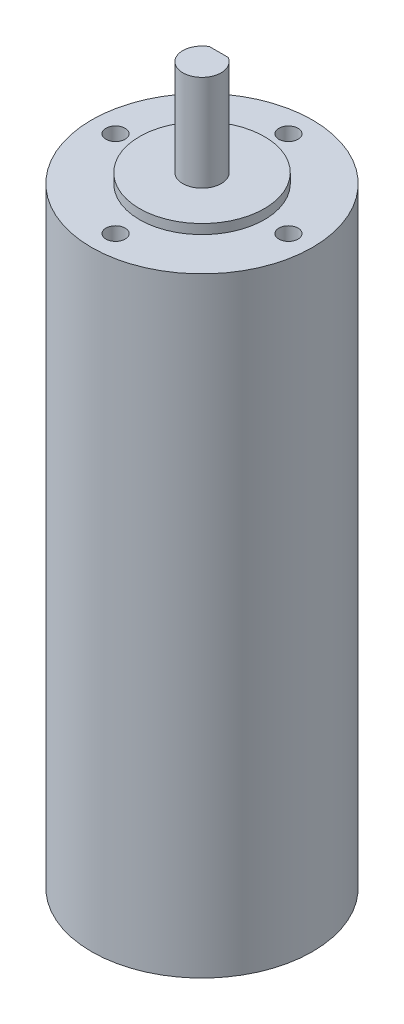
ISO-10303-21;
HEADER;
FILE_DESCRIPTION(('STEP AP214'),'2;1');
FILE_NAME('part.step','',(''),(''),'','','');
FILE_SCHEMA(('AUTOMOTIVE_DESIGN { 1 0 10303 214 1 1 1 1 }'));
ENDSEC;
DATA;
#1=APPLICATION_CONTEXT('core data for automotive mechanical design processes');
#2=APPLICATION_PROTOCOL_DEFINITION('international standard','automotive_design',2000,#1);
#3=PRODUCT_CONTEXT('',#1,'mechanical');
#4=PRODUCT('Part','Part','',(#3));
#5=PRODUCT_RELATED_PRODUCT_CATEGORY('part','',(#4));
#6=PRODUCT_DEFINITION_FORMATION('','',#4);
#7=PRODUCT_DEFINITION_CONTEXT('part definition',#1,'design');
#8=PRODUCT_DEFINITION('design','',#6,#7);
#9=PRODUCT_DEFINITION_SHAPE('','',#8);
#10=(LENGTH_UNIT() NAMED_UNIT(*) SI_UNIT(.MILLI.,.METRE.));
#11=(NAMED_UNIT(*) PLANE_ANGLE_UNIT() SI_UNIT($,.RADIAN.));
#12=(NAMED_UNIT(*) SI_UNIT($,.STERADIAN.) SOLID_ANGLE_UNIT());
#13=UNCERTAINTY_MEASURE_WITH_UNIT(LENGTH_MEASURE(1.E-05),#10,'distance_accuracy_value','');
#14=(GEOMETRIC_REPRESENTATION_CONTEXT(3) GLOBAL_UNCERTAINTY_ASSIGNED_CONTEXT((#13)) GLOBAL_UNIT_ASSIGNED_CONTEXT((#10,
#11,#12)) REPRESENTATION_CONTEXT('',''));
#15=CARTESIAN_POINT('',(0.,0.,0.));
#16=DIRECTION('',(0.,0.,1.));
#17=DIRECTION('',(1.,0.,0.));
#18=AXIS2_PLACEMENT_3D('',#15,#16,#17);
#19=CARTESIAN_POINT('',(0.,127.,0.));
#20=DIRECTION('',(0.,-1.,0.));
#21=DIRECTION('',(0.,0.,-1.));
#22=AXIS2_PLACEMENT_3D('',#19,#20,#21);
#23=CYLINDRICAL_SURFACE('',#22,23.);
#24=CARTESIAN_POINT('',(0.,127.,0.));
#25=DIRECTION('',(0.,1.,0.));
#26=DIRECTION('',(0.,0.,1.));
#27=AXIS2_PLACEMENT_3D('',#24,#25,#26);
#28=CIRCLE('',#27,23.);
#29=CARTESIAN_POINT('',(0.,127.,23.));
#30=VERTEX_POINT('',#29);
#31=EDGE_CURVE('E102',#30,#30,#28,.T.);
#32=ORIENTED_EDGE('',*,*,#31,.F.);
#33=EDGE_LOOP('',(#32));
#34=FACE_BOUND('',#33,.T.);
#35=CARTESIAN_POINT('',(0.,0.,0.));
#36=DIRECTION('',(0.,1.,0.));
#37=DIRECTION('',(0.,0.,1.));
#38=AXIS2_PLACEMENT_3D('',#35,#36,#37);
#39=CIRCLE('',#38,23.);
#40=CARTESIAN_POINT('',(0.,0.,23.));
#41=VERTEX_POINT('',#40);
#42=EDGE_CURVE('E44',#41,#41,#39,.T.);
#43=ORIENTED_EDGE('',*,*,#42,.T.);
#44=EDGE_LOOP('',(#43));
#45=FACE_BOUND('',#44,.T.);
#46=ADVANCED_FACE('F41',(#34,#45),#23,.T.);
#47=CARTESIAN_POINT('',(0.,127.,0.));
#48=DIRECTION('',(0.,1.,0.));
#49=DIRECTION('',(0.,0.,1.));
#50=AXIS2_PLACEMENT_3D('',#47,#48,#49);
#51=PLANE('',#50);
#52=CARTESIAN_POINT('',(0.,127.,-18.));
#53=DIRECTION('',(0.,1.,0.));
#54=DIRECTION('',(0.,0.,1.));
#55=AXIS2_PLACEMENT_3D('',#52,#53,#54);
#56=CIRCLE('',#55,2.);
#57=CARTESIAN_POINT('',(0.,127.,-16.));
#58=VERTEX_POINT('',#57);
#59=EDGE_CURVE('E95',#58,#58,#56,.T.);
#60=ORIENTED_EDGE('',*,*,#59,.F.);
#61=EDGE_LOOP('',(#60));
#62=FACE_BOUND('',#61,.T.);
#63=CARTESIAN_POINT('',(18.0000000000005,127.,-5.09386405508807E-13));
#64=DIRECTION('',(0.,1.,0.));
#65=DIRECTION('',(0.,0.,1.));
#66=AXIS2_PLACEMENT_3D('',#63,#64,#65);
#67=CIRCLE('',#66,2.);
#68=CARTESIAN_POINT('',(18.0000000000005,127.,1.99999999999949));
#69=VERTEX_POINT('',#68);
#70=EDGE_CURVE('E327',#69,#69,#67,.T.);
#71=ORIENTED_EDGE('',*,*,#70,.F.);
#72=EDGE_LOOP('',(#71));
#73=FACE_BOUND('',#72,.T.);
#74=CARTESIAN_POINT('',(9.96775622051246E-13,127.,18.));
#75=DIRECTION('',(0.,1.,0.));
#76=DIRECTION('',(0.,0.,1.));
#77=AXIS2_PLACEMENT_3D('',#74,#75,#76);
#78=CIRCLE('',#77,2.);
#79=CARTESIAN_POINT('',(9.96775622051246E-13,127.,20.));
#80=VERTEX_POINT('',#79);
#81=EDGE_CURVE('E335',#80,#80,#78,.T.);
#82=ORIENTED_EDGE('',*,*,#81,.F.);
#83=EDGE_LOOP('',(#82));
#84=FACE_BOUND('',#83,.T.);
#85=CARTESIAN_POINT('',(-17.9999999999995,127.,5.11590769747272E-13));
#86=DIRECTION('',(0.,1.,0.));
#87=DIRECTION('',(0.,0.,1.));
#88=AXIS2_PLACEMENT_3D('',#85,#86,#87);
#89=CIRCLE('',#88,2.);
#90=CARTESIAN_POINT('',(-17.9999999999995,127.,2.00000000000051));
#91=VERTEX_POINT('',#90);
#92=EDGE_CURVE('E83',#91,#91,#89,.T.);
#93=ORIENTED_EDGE('',*,*,#92,.F.);
#94=EDGE_LOOP('',(#93));
#95=FACE_BOUND('',#94,.T.);
#96=CARTESIAN_POINT('',(0.,127.,0.));
#97=DIRECTION('',(0.,1.,0.));
#98=DIRECTION('',(0.,0.,1.));
#99=AXIS2_PLACEMENT_3D('',#96,#97,#98);
#100=CIRCLE('',#99,13.);
#101=CARTESIAN_POINT('',(0.,127.,13.));
#102=VERTEX_POINT('',#101);
#103=EDGE_CURVE('E50',#102,#102,#100,.T.);
#104=ORIENTED_EDGE('',*,*,#103,.F.);
#105=EDGE_LOOP('',(#104));
#106=FACE_BOUND('',#105,.T.);
#107=ORIENTED_EDGE('',*,*,#31,.T.);
#108=EDGE_LOOP('',(#107));
#109=FACE_BOUND('',#108,.T.);
#110=ADVANCED_FACE('F115',(#62,#73,#84,#95,#106,#109),#51,.T.);
#111=CARTESIAN_POINT('',(0.,0.,0.));
#112=DIRECTION('',(0.,1.,0.));
#113=DIRECTION('',(0.,0.,1.));
#114=AXIS2_PLACEMENT_3D('',#111,#112,#113);
#115=PLANE('',#114);
#116=ORIENTED_EDGE('',*,*,#42,.F.);
#117=EDGE_LOOP('',(#116));
#118=FACE_BOUND('',#117,.T.);
#119=ADVANCED_FACE('F112',(#118),#115,.F.);
#120=CARTESIAN_POINT('',(0.,129.,0.));
#121=DIRECTION('',(0.,-1.,0.));
#122=DIRECTION('',(0.,0.,-1.));
#123=AXIS2_PLACEMENT_3D('',#120,#121,#122);
#124=CYLINDRICAL_SURFACE('',#123,13.);
#125=CARTESIAN_POINT('',(0.,129.,0.));
#126=DIRECTION('',(0.,1.,0.));
#127=DIRECTION('',(0.,0.,1.));
#128=AXIS2_PLACEMENT_3D('',#125,#126,#127);
#129=CIRCLE('',#128,13.);
#130=CARTESIAN_POINT('',(0.,129.,13.));
#131=VERTEX_POINT('',#130);
#132=EDGE_CURVE('E87',#131,#131,#129,.T.);
#133=ORIENTED_EDGE('',*,*,#132,.F.);
#134=EDGE_LOOP('',(#133));
#135=FACE_BOUND('',#134,.T.);
#136=ORIENTED_EDGE('',*,*,#103,.T.);
#137=EDGE_LOOP('',(#136));
#138=FACE_BOUND('',#137,.T.);
#139=ADVANCED_FACE('F114',(#135,#138),#124,.T.);
#140=CARTESIAN_POINT('',(0.,129.,0.));
#141=DIRECTION('',(0.,1.,0.));
#142=DIRECTION('',(0.,0.,1.));
#143=AXIS2_PLACEMENT_3D('',#140,#141,#142);
#144=PLANE('',#143);
#145=CARTESIAN_POINT('',(0.,129.,0.));
#146=DIRECTION('',(0.,1.,0.));
#147=DIRECTION('',(0.,0.,1.));
#148=AXIS2_PLACEMENT_3D('',#145,#146,#147);
#149=CIRCLE('',#148,4.);
#150=CARTESIAN_POINT('',(0.,129.,4.));
#151=VERTEX_POINT('',#150);
#152=EDGE_CURVE('E11',#151,#151,#149,.T.);
#153=ORIENTED_EDGE('',*,*,#152,.F.);
#154=EDGE_LOOP('',(#153));
#155=FACE_BOUND('',#154,.T.);
#156=ORIENTED_EDGE('',*,*,#132,.T.);
#157=EDGE_LOOP('',(#156));
#158=FACE_BOUND('',#157,.T.);
#159=ADVANCED_FACE('F120',(#155,#158),#144,.T.);
#160=CARTESIAN_POINT('',(0.,149.,0.));
#161=DIRECTION('',(0.,-1.,0.));
#162=DIRECTION('',(0.,0.,-1.));
#163=AXIS2_PLACEMENT_3D('',#160,#161,#162);
#164=CYLINDRICAL_SURFACE('',#163,4.);
#165=CARTESIAN_POINT('',(0.,149.,0.));
#166=DIRECTION('',(0.,1.,0.));
#167=DIRECTION('',(0.,0.,1.));
#168=AXIS2_PLACEMENT_3D('',#165,#166,#167);
#169=CIRCLE('',#168,4.);
#170=CARTESIAN_POINT('',(-1.93649167310371,149.,-3.5));
#171=VERTEX_POINT('',#170);
#172=CARTESIAN_POINT('',(1.93649167310371,149.,-3.5));
#173=VERTEX_POINT('',#172);
#174=EDGE_CURVE('E81',#171,#173,#169,.T.);
#175=ORIENTED_EDGE('',*,*,#174,.F.);
#176=DIRECTION('',(0.,1.,0.));
#177=VECTOR('',#176,1.);
#178=CARTESIAN_POINT('',(-1.93649167310371,137.,-3.5));
#179=LINE('',#178,#177);
#180=CARTESIAN_POINT('',(-1.93649167310371,137.,-3.5));
#181=VERTEX_POINT('',#180);
#182=EDGE_CURVE('E58',#181,#171,#179,.T.);
#183=ORIENTED_EDGE('',*,*,#182,.F.);
#184=CARTESIAN_POINT('',(0.,137.,0.));
#185=DIRECTION('',(0.,1.,0.));
#186=DIRECTION('',(0.,0.,1.));
#187=AXIS2_PLACEMENT_3D('',#184,#185,#186);
#188=CIRCLE('',#187,4.);
#189=CARTESIAN_POINT('',(1.93649167310371,137.,-3.5));
#190=VERTEX_POINT('',#189);
#191=EDGE_CURVE('E75',#190,#181,#188,.T.);
#192=ORIENTED_EDGE('',*,*,#191,.F.);
#193=DIRECTION('',(0.,1.,0.));
#194=VECTOR('',#193,1.);
#195=CARTESIAN_POINT('',(1.93649167310371,137.,-3.5));
#196=LINE('',#195,#194);
#197=EDGE_CURVE('E64',#190,#173,#196,.T.);
#198=ORIENTED_EDGE('',*,*,#197,.T.);
#199=EDGE_LOOP('',(#175,#183,#192,#198));
#200=FACE_BOUND('',#199,.T.);
#201=ORIENTED_EDGE('',*,*,#152,.T.);
#202=EDGE_LOOP('',(#201));
#203=FACE_BOUND('',#202,.T.);
#204=ADVANCED_FACE('F79',(#200,#203),#164,.T.);
#205=CARTESIAN_POINT('',(0.,149.,0.));
#206=DIRECTION('',(0.,1.,0.));
#207=DIRECTION('',(0.,0.,1.));
#208=AXIS2_PLACEMENT_3D('',#205,#206,#207);
#209=PLANE('',#208);
#210=DIRECTION('',(1.,0.,0.));
#211=VECTOR('',#210,1.);
#212=CARTESIAN_POINT('',(0.,149.,-3.5));
#213=LINE('',#212,#211);
#214=EDGE_CURVE('E69',#171,#173,#213,.T.);
#215=ORIENTED_EDGE('',*,*,#214,.F.);
#216=ORIENTED_EDGE('',*,*,#174,.T.);
#217=EDGE_LOOP('',(#215,#216));
#218=FACE_BOUND('',#217,.T.);
#219=ADVANCED_FACE('F85',(#218),#209,.T.);
#220=CARTESIAN_POINT('',(-17.9999999999995,117.,5.11590769747272E-13));
#221=DIRECTION('',(0.,1.,0.));
#222=DIRECTION('',(0.,0.,1.));
#223=AXIS2_PLACEMENT_3D('',#220,#221,#222);
#224=CYLINDRICAL_SURFACE('',#223,2.);
#225=CARTESIAN_POINT('',(-17.9999999999995,117.,5.11590769747272E-13));
#226=DIRECTION('',(0.,1.,0.));
#227=DIRECTION('',(0.,0.,1.));
#228=AXIS2_PLACEMENT_3D('',#225,#226,#227);
#229=CIRCLE('',#228,2.);
#230=CARTESIAN_POINT('',(-17.9999999999995,117.,2.00000000000051));
#231=VERTEX_POINT('',#230);
#232=EDGE_CURVE('E338',#231,#231,#229,.T.);
#233=ORIENTED_EDGE('',*,*,#232,.F.);
#234=EDGE_LOOP('',(#233));
#235=FACE_BOUND('',#234,.T.);
#236=ORIENTED_EDGE('',*,*,#92,.T.);
#237=EDGE_LOOP('',(#236));
#238=FACE_BOUND('',#237,.T.);
#239=ADVANCED_FACE('F143',(#235,#238),#224,.F.);
#240=CARTESIAN_POINT('',(-17.9999999999995,117.,5.11590769747272E-13));
#241=DIRECTION('',(0.,1.,0.));
#242=DIRECTION('',(0.,0.,1.));
#243=AXIS2_PLACEMENT_3D('',#240,#241,#242);
#244=PLANE('',#243);
#245=ORIENTED_EDGE('',*,*,#232,.T.);
#246=EDGE_LOOP('',(#245));
#247=FACE_BOUND('',#246,.T.);
#248=ADVANCED_FACE('F149',(#247),#244,.T.);
#249=CARTESIAN_POINT('',(9.96775622051246E-13,117.,18.));
#250=DIRECTION('',(0.,1.,0.));
#251=DIRECTION('',(0.,0.,1.));
#252=AXIS2_PLACEMENT_3D('',#249,#250,#251);
#253=CYLINDRICAL_SURFACE('',#252,2.);
#254=CARTESIAN_POINT('',(9.96775622051246E-13,117.,18.));
#255=DIRECTION('',(0.,1.,0.));
#256=DIRECTION('',(0.,0.,1.));
#257=AXIS2_PLACEMENT_3D('',#254,#255,#256);
#258=CIRCLE('',#257,2.);
#259=CARTESIAN_POINT('',(9.96775622051246E-13,117.,20.));
#260=VERTEX_POINT('',#259);
#261=EDGE_CURVE('E331',#260,#260,#258,.T.);
#262=ORIENTED_EDGE('',*,*,#261,.F.);
#263=EDGE_LOOP('',(#262));
#264=FACE_BOUND('',#263,.T.);
#265=ORIENTED_EDGE('',*,*,#81,.T.);
#266=EDGE_LOOP('',(#265));
#267=FACE_BOUND('',#266,.T.);
#268=ADVANCED_FACE('F163',(#264,#267),#253,.F.);
#269=CARTESIAN_POINT('',(9.96775622051246E-13,117.,18.));
#270=DIRECTION('',(0.,1.,0.));
#271=DIRECTION('',(0.,0.,1.));
#272=AXIS2_PLACEMENT_3D('',#269,#270,#271);
#273=PLANE('',#272);
#274=ORIENTED_EDGE('',*,*,#261,.T.);
#275=EDGE_LOOP('',(#274));
#276=FACE_BOUND('',#275,.T.);
#277=ADVANCED_FACE('F175',(#276),#273,.T.);
#278=CARTESIAN_POINT('',(18.0000000000005,117.,-5.09386405508807E-13));
#279=DIRECTION('',(0.,1.,0.));
#280=DIRECTION('',(0.,0.,1.));
#281=AXIS2_PLACEMENT_3D('',#278,#279,#280);
#282=CYLINDRICAL_SURFACE('',#281,2.);
#283=CARTESIAN_POINT('',(18.0000000000005,117.,-5.09386405508807E-13));
#284=DIRECTION('',(0.,1.,0.));
#285=DIRECTION('',(0.,0.,1.));
#286=AXIS2_PLACEMENT_3D('',#283,#284,#285);
#287=CIRCLE('',#286,2.);
#288=CARTESIAN_POINT('',(18.0000000000005,117.,1.99999999999949));
#289=VERTEX_POINT('',#288);
#290=EDGE_CURVE('E323',#289,#289,#287,.T.);
#291=ORIENTED_EDGE('',*,*,#290,.F.);
#292=EDGE_LOOP('',(#291));
#293=FACE_BOUND('',#292,.T.);
#294=ORIENTED_EDGE('',*,*,#70,.T.);
#295=EDGE_LOOP('',(#294));
#296=FACE_BOUND('',#295,.T.);
#297=ADVANCED_FACE('F186',(#293,#296),#282,.F.);
#298=CARTESIAN_POINT('',(18.0000000000005,117.,-5.09386405508807E-13));
#299=DIRECTION('',(0.,1.,0.));
#300=DIRECTION('',(0.,0.,1.));
#301=AXIS2_PLACEMENT_3D('',#298,#299,#300);
#302=PLANE('',#301);
#303=ORIENTED_EDGE('',*,*,#290,.T.);
#304=EDGE_LOOP('',(#303));
#305=FACE_BOUND('',#304,.T.);
#306=ADVANCED_FACE('F197',(#305),#302,.T.);
#307=CARTESIAN_POINT('',(0.,117.,-18.));
#308=DIRECTION('',(0.,1.,0.));
#309=DIRECTION('',(0.,0.,1.));
#310=AXIS2_PLACEMENT_3D('',#307,#308,#309);
#311=CYLINDRICAL_SURFACE('',#310,2.);
#312=CARTESIAN_POINT('',(0.,117.,-18.));
#313=DIRECTION('',(0.,1.,0.));
#314=DIRECTION('',(0.,0.,1.));
#315=AXIS2_PLACEMENT_3D('',#312,#313,#314);
#316=CIRCLE('',#315,2.);
#317=CARTESIAN_POINT('',(0.,117.,-16.));
#318=VERTEX_POINT('',#317);
#319=EDGE_CURVE('E88',#318,#318,#316,.T.);
#320=ORIENTED_EDGE('',*,*,#319,.F.);
#321=EDGE_LOOP('',(#320));
#322=FACE_BOUND('',#321,.T.);
#323=ORIENTED_EDGE('',*,*,#59,.T.);
#324=EDGE_LOOP('',(#323));
#325=FACE_BOUND('',#324,.T.);
#326=ADVANCED_FACE('F208',(#322,#325),#311,.F.);
#327=CARTESIAN_POINT('',(0.,117.,-18.));
#328=DIRECTION('',(0.,1.,0.));
#329=DIRECTION('',(0.,0.,1.));
#330=AXIS2_PLACEMENT_3D('',#327,#328,#329);
#331=PLANE('',#330);
#332=ORIENTED_EDGE('',*,*,#319,.T.);
#333=EDGE_LOOP('',(#332));
#334=FACE_BOUND('',#333,.T.);
#335=ADVANCED_FACE('F219',(#334),#331,.T.);
#336=CARTESIAN_POINT('',(0.,137.,-3.5));
#337=DIRECTION('',(0.,0.,1.));
#338=DIRECTION('',(1.,0.,0.));
#339=AXIS2_PLACEMENT_3D('',#336,#337,#338);
#340=PLANE('',#339);
#341=ORIENTED_EDGE('',*,*,#214,.T.);
#342=ORIENTED_EDGE('',*,*,#197,.F.);
#343=DIRECTION('',(1.,0.,0.));
#344=VECTOR('',#343,1.);
#345=CARTESIAN_POINT('',(0.,137.,-3.5));
#346=LINE('',#345,#344);
#347=EDGE_CURVE('E312',#181,#190,#346,.T.);
#348=ORIENTED_EDGE('',*,*,#347,.F.);
#349=ORIENTED_EDGE('',*,*,#182,.T.);
#350=EDGE_LOOP('',(#341,#342,#348,#349));
#351=FACE_BOUND('',#350,.T.);
#352=ADVANCED_FACE('F70',(#351),#340,.F.);
#353=CARTESIAN_POINT('',(0.,137.,0.));
#354=DIRECTION('',(0.,1.,0.));
#355=DIRECTION('',(0.,0.,1.));
#356=AXIS2_PLACEMENT_3D('',#353,#354,#355);
#357=PLANE('',#356);
#358=ORIENTED_EDGE('',*,*,#191,.T.);
#359=ORIENTED_EDGE('',*,*,#347,.T.);
#360=EDGE_LOOP('',(#358,#359));
#361=FACE_BOUND('',#360,.T.);
#362=ADVANCED_FACE('F256',(#361),#357,.T.);
#363=CLOSED_SHELL('',(#46,#110,#119,#139,#159,#204,#219,#239,#248,#268,#277,#297,#306,#326,#335,
#352,#362));
#364=MANIFOLD_SOLID_BREP('B2',#363);
#365=ADVANCED_BREP_SHAPE_REPRESENTATION('',(#18,#364),#14);
#366=SHAPE_DEFINITION_REPRESENTATION(#9,#365);
ENDSEC;
END-ISO-10303-21;
